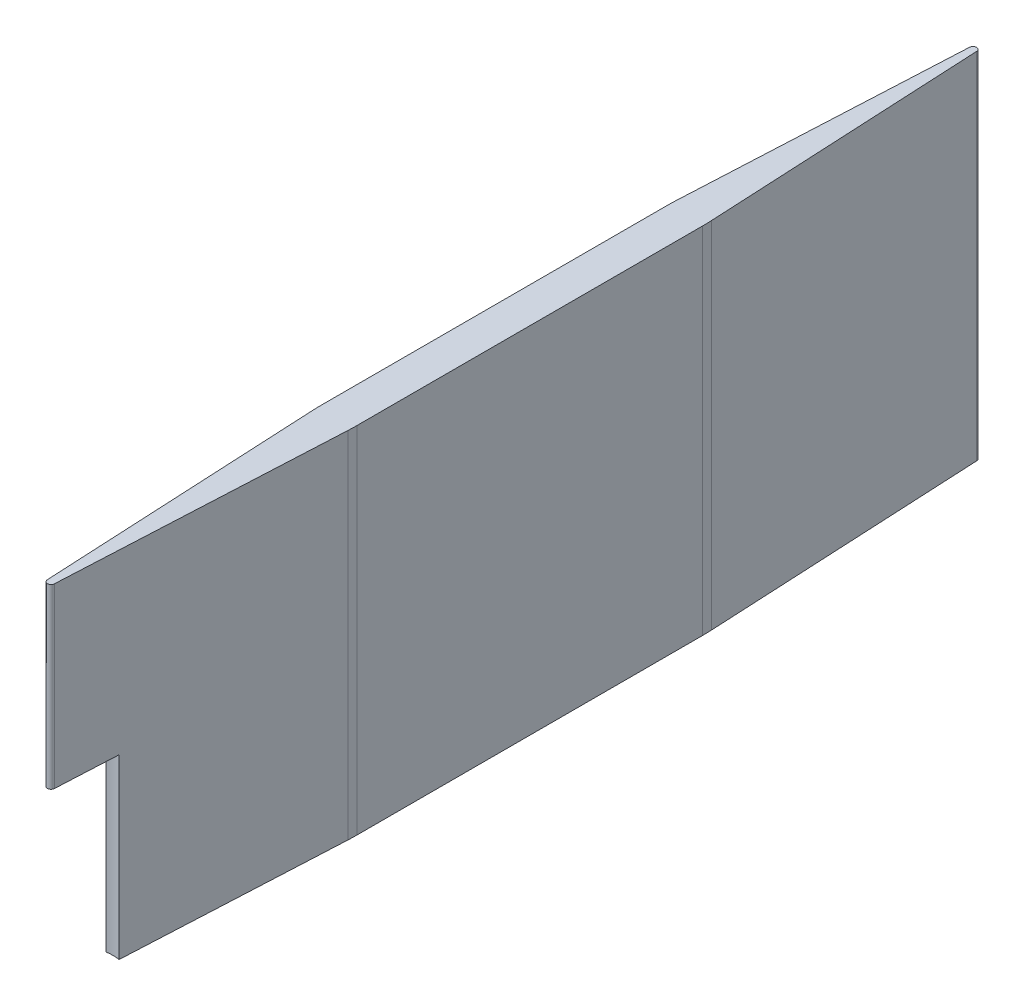
ISO-10303-21;
HEADER;
FILE_DESCRIPTION(('STEP AP214'),'2;1');
FILE_NAME('part.step','',(''),(''),'','','');
FILE_SCHEMA(('AUTOMOTIVE_DESIGN { 1 0 10303 214 1 1 1 1 }'));
ENDSEC;
DATA;
#1=APPLICATION_CONTEXT('core data for automotive mechanical design processes');
#2=APPLICATION_PROTOCOL_DEFINITION('international standard','automotive_design',2000,#1);
#3=PRODUCT_CONTEXT('',#1,'mechanical');
#4=PRODUCT('Part','Part','',(#3));
#5=PRODUCT_RELATED_PRODUCT_CATEGORY('part','',(#4));
#6=PRODUCT_DEFINITION_FORMATION('','',#4);
#7=PRODUCT_DEFINITION_CONTEXT('part definition',#1,'design');
#8=PRODUCT_DEFINITION('design','',#6,#7);
#9=PRODUCT_DEFINITION_SHAPE('','',#8);
#10=(LENGTH_UNIT() NAMED_UNIT(*) SI_UNIT(.MILLI.,.METRE.));
#11=(NAMED_UNIT(*) PLANE_ANGLE_UNIT() SI_UNIT($,.RADIAN.));
#12=(NAMED_UNIT(*) SI_UNIT($,.STERADIAN.) SOLID_ANGLE_UNIT());
#13=UNCERTAINTY_MEASURE_WITH_UNIT(LENGTH_MEASURE(1.E-05),#10,'distance_accuracy_value','');
#14=(GEOMETRIC_REPRESENTATION_CONTEXT(3) GLOBAL_UNCERTAINTY_ASSIGNED_CONTEXT((#13)) GLOBAL_UNIT_ASSIGNED_CONTEXT((#10,
#11,#12)) REPRESENTATION_CONTEXT('',''));
#15=CARTESIAN_POINT('',(0.,0.,0.));
#16=DIRECTION('',(0.,0.,1.));
#17=DIRECTION('',(1.,0.,0.));
#18=AXIS2_PLACEMENT_3D('',#15,#16,#17);
#19=CARTESIAN_POINT('',(-1.27,25.4,-25.4));
#20=DIRECTION('',(0.998752338877845,0.,-0.0499376169438921));
#21=DIRECTION('',(-0.0499376169438921,0.,-0.998752338877845));
#22=AXIS2_PLACEMENT_3D('',#19,#20,#21);
#23=PLANE('',#22);
#24=DIRECTION('',(0.,-1.,0.));
#25=VECTOR('',#24,1.);
#26=CARTESIAN_POINT('',(-0.474467398587078,12.7,-9.48934797174159));
#27=LINE('',#26,#25);
#28=CARTESIAN_POINT('',(-0.474467398587078,12.7,-9.48934797174159));
#29=VERTEX_POINT('',#28);
#30=CARTESIAN_POINT('',(-0.474467398587078,0.,-9.48934797174159));
#31=VERTEX_POINT('',#30);
#32=EDGE_CURVE('E54',#29,#31,#27,.T.);
#33=ORIENTED_EDGE('',*,*,#32,.F.);
#34=DIRECTION('',(0.0499376169438921,0.,0.998752338877845));
#35=VECTOR('',#34,1.);
#36=CARTESIAN_POINT('',(-1.27,12.7,-25.4));
#37=LINE('',#36,#35);
#38=CARTESIAN_POINT('',(-0.253683094074991,12.7,-5.07366188149983));
#39=VERTEX_POINT('',#38);
#40=EDGE_CURVE('E164',#29,#39,#37,.T.);
#41=ORIENTED_EDGE('',*,*,#40,.T.);
#42=DIRECTION('',(0.,-1.,0.));
#43=VECTOR('',#42,1.);
#44=CARTESIAN_POINT('',(-0.253683094074991,25.4,-5.07366188149983));
#45=LINE('',#44,#43);
#46=CARTESIAN_POINT('',(-0.253683094074991,25.4,-5.07366188149983));
#47=VERTEX_POINT('',#46);
#48=EDGE_CURVE('E175',#47,#39,#45,.T.);
#49=ORIENTED_EDGE('',*,*,#48,.F.);
#50=DIRECTION('',(0.0499376169438921,0.,0.998752338877845));
#51=VECTOR('',#50,1.);
#52=CARTESIAN_POINT('',(-1.27,25.4,-25.4));
#53=LINE('',#52,#51);
#54=CARTESIAN_POINT('',(-1.25415470374862,25.4,-25.0830940749725));
#55=VERTEX_POINT('',#54);
#56=EDGE_CURVE('E265',#55,#47,#53,.T.);
#57=ORIENTED_EDGE('',*,*,#56,.F.);
#58=DIRECTION('',(0.,-1.,0.));
#59=VECTOR('',#58,1.);
#60=CARTESIAN_POINT('',(-1.25415470374862,25.4,-25.0830940749725));
#61=LINE('',#60,#59);
#62=CARTESIAN_POINT('',(-1.25415470374862,0.,-25.0830940749725));
#63=VERTEX_POINT('',#62);
#64=EDGE_CURVE('E179',#55,#63,#61,.T.);
#65=ORIENTED_EDGE('',*,*,#64,.T.);
#66=DIRECTION('',(0.0499376169438921,0.,0.998752338877845));
#67=VECTOR('',#66,1.);
#68=CARTESIAN_POINT('',(-1.27,0.,-25.4));
#69=LINE('',#68,#67);
#70=EDGE_CURVE('E282',#63,#31,#69,.T.);
#71=ORIENTED_EDGE('',*,*,#70,.T.);
#72=EDGE_LOOP('',(#33,#41,#49,#57,#65,#71));
#73=FACE_BOUND('',#72,.T.);
#74=ADVANCED_FACE('F39',(#73),#23,.F.);
#75=CARTESIAN_POINT('',(1.27,25.4,-25.4));
#76=DIRECTION('',(-0.998752338877845,0.,-0.0499376169438921));
#77=DIRECTION('',(-0.0499376169438921,0.,0.998752338877845));
#78=AXIS2_PLACEMENT_3D('',#75,#76,#77);
#79=PLANE('',#78);
#80=DIRECTION('',(0.,-1.,0.));
#81=VECTOR('',#80,1.);
#82=CARTESIAN_POINT('',(0.474467398587078,12.7,-9.48934797174159));
#83=LINE('',#82,#81);
#84=CARTESIAN_POINT('',(0.474467398587078,0.,-9.48934797174159));
#85=VERTEX_POINT('',#84);
#86=CARTESIAN_POINT('',(0.474467398587078,12.7,-9.48934797174159));
#87=VERTEX_POINT('',#86);
#88=EDGE_CURVE('E152',#85,#87,#83,.F.);
#89=ORIENTED_EDGE('',*,*,#88,.F.);
#90=DIRECTION('',(0.0499376169438921,0.,-0.998752338877845));
#91=VECTOR('',#90,1.);
#92=CARTESIAN_POINT('',(1.27,0.,-25.4));
#93=LINE('',#92,#91);
#94=CARTESIAN_POINT('',(1.25415470374862,0.,-25.0830940749725));
#95=VERTEX_POINT('',#94);
#96=EDGE_CURVE('E256',#85,#95,#93,.T.);
#97=ORIENTED_EDGE('',*,*,#96,.T.);
#98=DIRECTION('',(0.,-1.,0.));
#99=VECTOR('',#98,1.);
#100=CARTESIAN_POINT('',(1.25415470374862,25.4,-25.0830940749725));
#101=LINE('',#100,#99);
#102=CARTESIAN_POINT('',(1.25415470374862,25.4,-25.0830940749725));
#103=VERTEX_POINT('',#102);
#104=EDGE_CURVE('E228',#95,#103,#101,.F.);
#105=ORIENTED_EDGE('',*,*,#104,.T.);
#106=DIRECTION('',(0.0499376169438921,0.,-0.998752338877845));
#107=VECTOR('',#106,1.);
#108=CARTESIAN_POINT('',(1.27,25.4,-25.4));
#109=LINE('',#108,#107);
#110=CARTESIAN_POINT('',(0.253683094074991,25.4,-5.07366188149983));
#111=VERTEX_POINT('',#110);
#112=EDGE_CURVE('E172',#111,#103,#109,.T.);
#113=ORIENTED_EDGE('',*,*,#112,.F.);
#114=DIRECTION('',(0.,-1.,0.));
#115=VECTOR('',#114,1.);
#116=CARTESIAN_POINT('',(0.253683094074991,25.4,-5.07366188149983));
#117=LINE('',#116,#115);
#118=CARTESIAN_POINT('',(0.253683094074991,12.7,-5.07366188149983));
#119=VERTEX_POINT('',#118);
#120=EDGE_CURVE('E170',#111,#119,#117,.T.);
#121=ORIENTED_EDGE('',*,*,#120,.T.);
#122=DIRECTION('',(0.0499376169438921,0.,-0.998752338877845));
#123=VECTOR('',#122,1.);
#124=CARTESIAN_POINT('',(1.27,12.7,-25.4));
#125=LINE('',#124,#123);
#126=EDGE_CURVE('E11',#119,#87,#125,.T.);
#127=ORIENTED_EDGE('',*,*,#126,.T.);
#128=EDGE_LOOP('',(#89,#97,#105,#113,#121,#127));
#129=FACE_BOUND('',#128,.T.);
#130=ADVANCED_FACE('F167',(#129),#79,.F.);
#131=CARTESIAN_POINT('',(0.,0.,-5.08634603620323));
#132=DIRECTION('',(0.,1.,0.));
#133=DIRECTION('',(0.,0.,1.));
#134=AXIS2_PLACEMENT_3D('',#131,#132,#133);
#135=PLANE('',#134);
#136=CARTESIAN_POINT('',(0.,0.,-6.35));
#137=DIRECTION('',(0.,1.,0.));
#138=DIRECTION('',(0.,0.,1.));
#139=AXIS2_PLACEMENT_3D('',#136,#137,#138);
#140=CIRCLE('',#139,3.175);
#141=EDGE_CURVE('E156',#85,#31,#140,.T.);
#142=ORIENTED_EDGE('',*,*,#141,.T.);
#143=ORIENTED_EDGE('',*,*,#70,.F.);
#144=CARTESIAN_POINT('',(11.43,0.,-25.71730181016));
#145=DIRECTION('',(0.,1.,0.));
#146=DIRECTION('',(0.,0.,1.));
#147=AXIS2_PLACEMENT_3D('',#144,#145,#146);
#148=CIRCLE('',#147,12.7);
#149=CARTESIAN_POINT('',(-1.27,0.,-25.71730181016));
#150=VERTEX_POINT('',#149);
#151=EDGE_CURVE('E200',#63,#150,#148,.F.);
#152=ORIENTED_EDGE('',*,*,#151,.T.);
#153=DIRECTION('',(0.,0.,1.));
#154=VECTOR('',#153,1.);
#155=CARTESIAN_POINT('',(-1.27,0.,-50.8));
#156=LINE('',#155,#154);
#157=CARTESIAN_POINT('',(-1.27,0.,-50.48269818984));
#158=VERTEX_POINT('',#157);
#159=EDGE_CURVE('E262',#158,#150,#156,.T.);
#160=ORIENTED_EDGE('',*,*,#159,.F.);
#161=CARTESIAN_POINT('',(11.43,0.,-50.48269818984));
#162=DIRECTION('',(0.,1.,0.));
#163=DIRECTION('',(0.,0.,1.));
#164=AXIS2_PLACEMENT_3D('',#161,#162,#163);
#165=CIRCLE('',#164,12.7);
#166=CARTESIAN_POINT('',(-1.25415470374863,0.,-51.1169059250275));
#167=VERTEX_POINT('',#166);
#168=EDGE_CURVE('E197',#158,#167,#165,.F.);
#169=ORIENTED_EDGE('',*,*,#168,.T.);
#170=DIRECTION('',(-0.0499376169438922,0.,0.998752338877845));
#171=VECTOR('',#170,1.);
#172=CARTESIAN_POINT('',(-1.27,0.,-50.8));
#173=LINE('',#172,#171);
#174=CARTESIAN_POINT('',(-0.253683094074991,0.,-71.1263381185002));
#175=VERTEX_POINT('',#174);
#176=EDGE_CURVE('E253',#175,#167,#173,.T.);
#177=ORIENTED_EDGE('',*,*,#176,.F.);
#178=CARTESIAN_POINT('',(0.,0.,-71.1136539637968));
#179=DIRECTION('',(0.,1.,0.));
#180=DIRECTION('',(0.,0.,-1.));
#181=AXIS2_PLACEMENT_3D('',#178,#179,#180);
#182=CIRCLE('',#181,0.254);
#183=CARTESIAN_POINT('',(0.253683094074991,0.,-71.1263381185002));
#184=VERTEX_POINT('',#183);
#185=EDGE_CURVE('E248',#184,#175,#182,.T.);
#186=ORIENTED_EDGE('',*,*,#185,.F.);
#187=DIRECTION('',(-0.0499376169438922,0.,-0.998752338877845));
#188=VECTOR('',#187,1.);
#189=CARTESIAN_POINT('',(1.27,0.,-50.8));
#190=LINE('',#189,#188);
#191=CARTESIAN_POINT('',(1.25415470374863,0.,-51.1169059250275));
#192=VERTEX_POINT('',#191);
#193=EDGE_CURVE('E238',#192,#184,#190,.T.);
#194=ORIENTED_EDGE('',*,*,#193,.F.);
#195=CARTESIAN_POINT('',(-11.43,0.,-50.48269818984));
#196=DIRECTION('',(0.,1.,0.));
#197=DIRECTION('',(0.,0.,1.));
#198=AXIS2_PLACEMENT_3D('',#195,#196,#197);
#199=CIRCLE('',#198,12.7);
#200=CARTESIAN_POINT('',(1.27,0.,-50.48269818984));
#201=VERTEX_POINT('',#200);
#202=EDGE_CURVE('E190',#192,#201,#199,.F.);
#203=ORIENTED_EDGE('',*,*,#202,.T.);
#204=DIRECTION('',(0.,0.,-1.));
#205=VECTOR('',#204,1.);
#206=CARTESIAN_POINT('',(1.27,0.,-50.8));
#207=LINE('',#206,#205);
#208=CARTESIAN_POINT('',(1.27,0.,-25.71730181016));
#209=VERTEX_POINT('',#208);
#210=EDGE_CURVE('E250',#209,#201,#207,.T.);
#211=ORIENTED_EDGE('',*,*,#210,.F.);
#212=CARTESIAN_POINT('',(-11.43,0.,-25.71730181016));
#213=DIRECTION('',(0.,1.,0.));
#214=DIRECTION('',(0.,0.,1.));
#215=AXIS2_PLACEMENT_3D('',#212,#213,#214);
#216=CIRCLE('',#215,12.7);
#217=EDGE_CURVE('E193',#209,#95,#216,.F.);
#218=ORIENTED_EDGE('',*,*,#217,.T.);
#219=ORIENTED_EDGE('',*,*,#96,.F.);
#220=EDGE_LOOP('',(#142,#143,#152,#160,#169,#177,#186,#194,#203,#211,#218,#219));
#221=FACE_BOUND('',#220,.T.);
#222=ADVANCED_FACE('F244',(#221),#135,.F.);
#223=CARTESIAN_POINT('',(0.,25.4,-5.08634603620323));
#224=DIRECTION('',(0.,-1.,0.));
#225=DIRECTION('',(0.,0.,-1.));
#226=AXIS2_PLACEMENT_3D('',#223,#224,#225);
#227=CYLINDRICAL_SURFACE('',#226,0.254000000000001);
#228=ORIENTED_EDGE('',*,*,#48,.T.);
#229=CARTESIAN_POINT('',(0.,12.7,-5.08634603620323));
#230=DIRECTION('',(0.,1.,0.));
#231=DIRECTION('',(0.,0.,1.));
#232=AXIS2_PLACEMENT_3D('',#229,#230,#231);
#233=CIRCLE('',#232,0.254000000000001);
#234=EDGE_CURVE('E360',#39,#119,#233,.T.);
#235=ORIENTED_EDGE('',*,*,#234,.T.);
#236=ORIENTED_EDGE('',*,*,#120,.F.);
#237=CARTESIAN_POINT('',(0.,25.4,-5.08634603620323));
#238=DIRECTION('',(0.,1.,0.));
#239=DIRECTION('',(0.,0.,1.));
#240=AXIS2_PLACEMENT_3D('',#237,#238,#239);
#241=CIRCLE('',#240,0.254000000000001);
#242=EDGE_CURVE('E301',#47,#111,#241,.T.);
#243=ORIENTED_EDGE('',*,*,#242,.F.);
#244=EDGE_LOOP('',(#228,#235,#236,#243));
#245=FACE_BOUND('',#244,.T.);
#246=ADVANCED_FACE('F328',(#245),#227,.T.);
#247=CARTESIAN_POINT('',(1.27,25.4,-50.8));
#248=DIRECTION('',(-1.,0.,0.));
#249=DIRECTION('',(0.,0.,1.));
#250=AXIS2_PLACEMENT_3D('',#247,#248,#249);
#251=PLANE('',#250);
#252=DIRECTION('',(0.,0.,-1.));
#253=VECTOR('',#252,1.);
#254=CARTESIAN_POINT('',(1.27,25.4,-50.8));
#255=LINE('',#254,#253);
#256=CARTESIAN_POINT('',(1.27,25.4,-25.71730181016));
#257=VERTEX_POINT('',#256);
#258=CARTESIAN_POINT('',(1.27,25.4,-50.48269818984));
#259=VERTEX_POINT('',#258);
#260=EDGE_CURVE('E294',#257,#259,#255,.T.);
#261=ORIENTED_EDGE('',*,*,#260,.F.);
#262=DIRECTION('',(0.,-1.,0.));
#263=VECTOR('',#262,1.);
#264=CARTESIAN_POINT('',(1.27,25.4,-25.71730181016));
#265=LINE('',#264,#263);
#266=EDGE_CURVE('E224',#257,#209,#265,.T.);
#267=ORIENTED_EDGE('',*,*,#266,.T.);
#268=ORIENTED_EDGE('',*,*,#210,.T.);
#269=DIRECTION('',(0.,-1.,0.));
#270=VECTOR('',#269,1.);
#271=CARTESIAN_POINT('',(1.27,25.4,-50.48269818984));
#272=LINE('',#271,#270);
#273=EDGE_CURVE('E221',#201,#259,#272,.F.);
#274=ORIENTED_EDGE('',*,*,#273,.T.);
#275=EDGE_LOOP('',(#261,#267,#268,#274));
#276=FACE_BOUND('',#275,.T.);
#277=ADVANCED_FACE('F296',(#276),#251,.F.);
#278=CARTESIAN_POINT('',(1.27,25.4,-50.8));
#279=DIRECTION('',(-0.998752338877845,0.,0.0499376169438922));
#280=DIRECTION('',(0.0499376169438922,0.,0.998752338877845));
#281=AXIS2_PLACEMENT_3D('',#278,#279,#280);
#282=PLANE('',#281);
#283=DIRECTION('',(-0.0499376169438922,0.,-0.998752338877845));
#284=VECTOR('',#283,1.);
#285=CARTESIAN_POINT('',(1.27,25.4,-50.8));
#286=LINE('',#285,#284);
#287=CARTESIAN_POINT('',(1.25415470374863,25.4,-51.1169059250275));
#288=VERTEX_POINT('',#287);
#289=CARTESIAN_POINT('',(0.253683094074991,25.4,-71.1263381185002));
#290=VERTEX_POINT('',#289);
#291=EDGE_CURVE('E239',#288,#290,#286,.T.);
#292=ORIENTED_EDGE('',*,*,#291,.F.);
#293=DIRECTION('',(0.,-1.,0.));
#294=VECTOR('',#293,1.);
#295=CARTESIAN_POINT('',(1.25415470374863,25.4,-51.1169059250275));
#296=LINE('',#295,#294);
#297=EDGE_CURVE('E47',#288,#192,#296,.T.);
#298=ORIENTED_EDGE('',*,*,#297,.T.);
#299=ORIENTED_EDGE('',*,*,#193,.T.);
#300=DIRECTION('',(0.,-1.,0.));
#301=VECTOR('',#300,1.);
#302=CARTESIAN_POINT('',(0.253683094074991,25.4,-71.1263381185002));
#303=LINE('',#302,#301);
#304=EDGE_CURVE('E176',#290,#184,#303,.T.);
#305=ORIENTED_EDGE('',*,*,#304,.F.);
#306=EDGE_LOOP('',(#292,#298,#299,#305));
#307=FACE_BOUND('',#306,.T.);
#308=ADVANCED_FACE('F236',(#307),#282,.F.);
#309=CARTESIAN_POINT('',(0.,25.4,-71.1136539637968));
#310=DIRECTION('',(0.,-1.,0.));
#311=DIRECTION('',(0.,0.,-1.));
#312=AXIS2_PLACEMENT_3D('',#309,#310,#311);
#313=CYLINDRICAL_SURFACE('',#312,0.254);
#314=ORIENTED_EDGE('',*,*,#185,.T.);
#315=DIRECTION('',(0.,-1.,0.));
#316=VECTOR('',#315,1.);
#317=CARTESIAN_POINT('',(-0.253683094074991,25.4,-71.1263381185002));
#318=LINE('',#317,#316);
#319=CARTESIAN_POINT('',(-0.253683094074991,25.4,-71.1263381185002));
#320=VERTEX_POINT('',#319);
#321=EDGE_CURVE('E183',#320,#175,#318,.T.);
#322=ORIENTED_EDGE('',*,*,#321,.F.);
#323=CARTESIAN_POINT('',(0.,25.4,-71.1136539637968));
#324=DIRECTION('',(0.,1.,0.));
#325=DIRECTION('',(0.,0.,-1.));
#326=AXIS2_PLACEMENT_3D('',#323,#324,#325);
#327=CIRCLE('',#326,0.254);
#328=EDGE_CURVE('E278',#290,#320,#327,.T.);
#329=ORIENTED_EDGE('',*,*,#328,.F.);
#330=ORIENTED_EDGE('',*,*,#304,.T.);
#331=EDGE_LOOP('',(#314,#322,#329,#330));
#332=FACE_BOUND('',#331,.T.);
#333=ADVANCED_FACE('F307',(#332),#313,.T.);
#334=CARTESIAN_POINT('',(-1.27,25.4,-50.8));
#335=DIRECTION('',(0.998752338877845,0.,0.0499376169438922));
#336=DIRECTION('',(0.0499376169438922,0.,-0.998752338877845));
#337=AXIS2_PLACEMENT_3D('',#334,#335,#336);
#338=PLANE('',#337);
#339=ORIENTED_EDGE('',*,*,#176,.T.);
#340=DIRECTION('',(0.,-1.,0.));
#341=VECTOR('',#340,1.);
#342=CARTESIAN_POINT('',(-1.25415470374863,25.4,-51.1169059250275));
#343=LINE('',#342,#341);
#344=CARTESIAN_POINT('',(-1.25415470374863,25.4,-51.1169059250275));
#345=VERTEX_POINT('',#344);
#346=EDGE_CURVE('E62',#167,#345,#343,.F.);
#347=ORIENTED_EDGE('',*,*,#346,.T.);
#348=DIRECTION('',(-0.0499376169438922,0.,0.998752338877845));
#349=VECTOR('',#348,1.);
#350=CARTESIAN_POINT('',(-1.27,25.4,-50.8));
#351=LINE('',#350,#349);
#352=EDGE_CURVE('E272',#320,#345,#351,.T.);
#353=ORIENTED_EDGE('',*,*,#352,.F.);
#354=ORIENTED_EDGE('',*,*,#321,.T.);
#355=EDGE_LOOP('',(#339,#347,#353,#354));
#356=FACE_BOUND('',#355,.T.);
#357=ADVANCED_FACE('F308',(#356),#338,.F.);
#358=CARTESIAN_POINT('',(-1.27,25.4,-50.8));
#359=DIRECTION('',(1.,0.,0.));
#360=DIRECTION('',(0.,0.,-1.));
#361=AXIS2_PLACEMENT_3D('',#358,#359,#360);
#362=PLANE('',#361);
#363=ORIENTED_EDGE('',*,*,#159,.T.);
#364=DIRECTION('',(0.,-1.,0.));
#365=VECTOR('',#364,1.);
#366=CARTESIAN_POINT('',(-1.27,25.4,-25.71730181016));
#367=LINE('',#366,#365);
#368=CARTESIAN_POINT('',(-1.27,25.4,-25.71730181016));
#369=VERTEX_POINT('',#368);
#370=EDGE_CURVE('E206',#150,#369,#367,.F.);
#371=ORIENTED_EDGE('',*,*,#370,.T.);
#372=DIRECTION('',(0.,0.,1.));
#373=VECTOR('',#372,1.);
#374=CARTESIAN_POINT('',(-1.27,25.4,-50.8));
#375=LINE('',#374,#373);
#376=CARTESIAN_POINT('',(-1.27,25.4,-50.48269818984));
#377=VERTEX_POINT('',#376);
#378=EDGE_CURVE('E268',#377,#369,#375,.T.);
#379=ORIENTED_EDGE('',*,*,#378,.F.);
#380=DIRECTION('',(0.,-1.,0.));
#381=VECTOR('',#380,1.);
#382=CARTESIAN_POINT('',(-1.27,25.4,-50.48269818984));
#383=LINE('',#382,#381);
#384=EDGE_CURVE('E202',#377,#158,#383,.T.);
#385=ORIENTED_EDGE('',*,*,#384,.T.);
#386=EDGE_LOOP('',(#363,#371,#379,#385));
#387=FACE_BOUND('',#386,.T.);
#388=ADVANCED_FACE('F310',(#387),#362,.F.);
#389=CARTESIAN_POINT('',(0.,25.4,-5.08634603620323));
#390=DIRECTION('',(0.,1.,0.));
#391=DIRECTION('',(0.,0.,1.));
#392=AXIS2_PLACEMENT_3D('',#389,#390,#391);
#393=PLANE('',#392);
#394=ORIENTED_EDGE('',*,*,#378,.T.);
#395=CARTESIAN_POINT('',(11.43,25.4,-25.71730181016));
#396=DIRECTION('',(0.,1.,0.));
#397=DIRECTION('',(0.,0.,1.));
#398=AXIS2_PLACEMENT_3D('',#395,#396,#397);
#399=CIRCLE('',#398,12.7);
#400=EDGE_CURVE('E216',#369,#55,#399,.T.);
#401=ORIENTED_EDGE('',*,*,#400,.T.);
#402=ORIENTED_EDGE('',*,*,#56,.T.);
#403=ORIENTED_EDGE('',*,*,#242,.T.);
#404=ORIENTED_EDGE('',*,*,#112,.T.);
#405=CARTESIAN_POINT('',(-11.43,25.4,-25.71730181016));
#406=DIRECTION('',(0.,1.,0.));
#407=DIRECTION('',(0.,0.,1.));
#408=AXIS2_PLACEMENT_3D('',#405,#406,#407);
#409=CIRCLE('',#408,12.7);
#410=EDGE_CURVE('E211',#103,#257,#409,.T.);
#411=ORIENTED_EDGE('',*,*,#410,.T.);
#412=ORIENTED_EDGE('',*,*,#260,.T.);
#413=CARTESIAN_POINT('',(-11.43,25.4,-50.48269818984));
#414=DIRECTION('',(0.,1.,0.));
#415=DIRECTION('',(0.,0.,1.));
#416=AXIS2_PLACEMENT_3D('',#413,#414,#415);
#417=CIRCLE('',#416,12.7);
#418=EDGE_CURVE('E209',#259,#288,#417,.T.);
#419=ORIENTED_EDGE('',*,*,#418,.T.);
#420=ORIENTED_EDGE('',*,*,#291,.T.);
#421=ORIENTED_EDGE('',*,*,#328,.T.);
#422=ORIENTED_EDGE('',*,*,#352,.T.);
#423=CARTESIAN_POINT('',(11.43,25.4,-50.48269818984));
#424=DIRECTION('',(0.,1.,0.));
#425=DIRECTION('',(0.,0.,1.));
#426=AXIS2_PLACEMENT_3D('',#423,#424,#425);
#427=CIRCLE('',#426,12.7);
#428=EDGE_CURVE('E214',#345,#377,#427,.T.);
#429=ORIENTED_EDGE('',*,*,#428,.T.);
#430=EDGE_LOOP('',(#394,#401,#402,#403,#404,#411,#412,#419,#420,#421,#422,#429));
#431=FACE_BOUND('',#430,.T.);
#432=ADVANCED_FACE('F293',(#431),#393,.T.);
#433=CARTESIAN_POINT('',(11.43,25.4,-25.71730181016));
#434=DIRECTION('',(0.,-1.,0.));
#435=DIRECTION('',(0.,0.,-1.));
#436=AXIS2_PLACEMENT_3D('',#433,#434,#435);
#437=CYLINDRICAL_SURFACE('',#436,12.7);
#438=ORIENTED_EDGE('',*,*,#400,.F.);
#439=ORIENTED_EDGE('',*,*,#370,.F.);
#440=ORIENTED_EDGE('',*,*,#151,.F.);
#441=ORIENTED_EDGE('',*,*,#64,.F.);
#442=EDGE_LOOP('',(#438,#439,#440,#441));
#443=FACE_BOUND('',#442,.T.);
#444=ADVANCED_FACE('F329',(#443),#437,.T.);
#445=CARTESIAN_POINT('',(11.43,25.4,-50.48269818984));
#446=DIRECTION('',(0.,-1.,0.));
#447=DIRECTION('',(0.,0.,-1.));
#448=AXIS2_PLACEMENT_3D('',#445,#446,#447);
#449=CYLINDRICAL_SURFACE('',#448,12.7);
#450=ORIENTED_EDGE('',*,*,#428,.F.);
#451=ORIENTED_EDGE('',*,*,#346,.F.);
#452=ORIENTED_EDGE('',*,*,#168,.F.);
#453=ORIENTED_EDGE('',*,*,#384,.F.);
#454=EDGE_LOOP('',(#450,#451,#452,#453));
#455=FACE_BOUND('',#454,.T.);
#456=ADVANCED_FACE('F332',(#455),#449,.T.);
#457=CARTESIAN_POINT('',(-11.43,25.4,-25.71730181016));
#458=DIRECTION('',(0.,-1.,0.));
#459=DIRECTION('',(0.,0.,-1.));
#460=AXIS2_PLACEMENT_3D('',#457,#458,#459);
#461=CYLINDRICAL_SURFACE('',#460,12.7);
#462=ORIENTED_EDGE('',*,*,#410,.F.);
#463=ORIENTED_EDGE('',*,*,#104,.F.);
#464=ORIENTED_EDGE('',*,*,#217,.F.);
#465=ORIENTED_EDGE('',*,*,#266,.F.);
#466=EDGE_LOOP('',(#462,#463,#464,#465));
#467=FACE_BOUND('',#466,.T.);
#468=ADVANCED_FACE('F290',(#467),#461,.T.);
#469=CARTESIAN_POINT('',(-11.43,25.4,-50.48269818984));
#470=DIRECTION('',(0.,-1.,0.));
#471=DIRECTION('',(0.,0.,-1.));
#472=AXIS2_PLACEMENT_3D('',#469,#470,#471);
#473=CYLINDRICAL_SURFACE('',#472,12.7);
#474=ORIENTED_EDGE('',*,*,#418,.F.);
#475=ORIENTED_EDGE('',*,*,#273,.F.);
#476=ORIENTED_EDGE('',*,*,#202,.F.);
#477=ORIENTED_EDGE('',*,*,#297,.F.);
#478=EDGE_LOOP('',(#474,#475,#476,#477));
#479=FACE_BOUND('',#478,.T.);
#480=ADVANCED_FACE('F41',(#479),#473,.T.);
#481=CARTESIAN_POINT('',(0.,12.7,-6.35));
#482=DIRECTION('',(0.,1.,0.));
#483=DIRECTION('',(0.,0.,1.));
#484=AXIS2_PLACEMENT_3D('',#481,#482,#483);
#485=PLANE('',#484);
#486=CARTESIAN_POINT('',(0.,12.7,-6.35));
#487=DIRECTION('',(0.,1.,0.));
#488=DIRECTION('',(0.,0.,1.));
#489=AXIS2_PLACEMENT_3D('',#486,#487,#488);
#490=CIRCLE('',#489,3.175);
#491=EDGE_CURVE('E155',#87,#29,#490,.T.);
#492=ORIENTED_EDGE('',*,*,#491,.F.);
#493=ORIENTED_EDGE('',*,*,#126,.F.);
#494=ORIENTED_EDGE('',*,*,#234,.F.);
#495=ORIENTED_EDGE('',*,*,#40,.F.);
#496=EDGE_LOOP('',(#492,#493,#494,#495));
#497=FACE_BOUND('',#496,.T.);
#498=ADVANCED_FACE('F161',(#497),#485,.F.);
#499=CARTESIAN_POINT('',(0.,12.7,-6.35));
#500=DIRECTION('',(0.,-1.,0.));
#501=DIRECTION('',(0.,0.,-1.));
#502=AXIS2_PLACEMENT_3D('',#499,#500,#501);
#503=CYLINDRICAL_SURFACE('',#502,3.175);
#504=ORIENTED_EDGE('',*,*,#32,.T.);
#505=ORIENTED_EDGE('',*,*,#141,.F.);
#506=ORIENTED_EDGE('',*,*,#88,.T.);
#507=ORIENTED_EDGE('',*,*,#491,.T.);
#508=EDGE_LOOP('',(#504,#505,#506,#507));
#509=FACE_BOUND('',#508,.T.);
#510=ADVANCED_FACE('F154',(#509),#503,.F.);
#511=CLOSED_SHELL('',(#74,#130,#222,#246,#277,#308,#333,#357,#388,#432,#444,#456,#468,#480,#498,#510));
#512=MANIFOLD_SOLID_BREP('B2',#511);
#513=ADVANCED_BREP_SHAPE_REPRESENTATION('',(#18,#512),#14);
#514=SHAPE_DEFINITION_REPRESENTATION(#9,#513);
ENDSEC;
END-ISO-10303-21;
